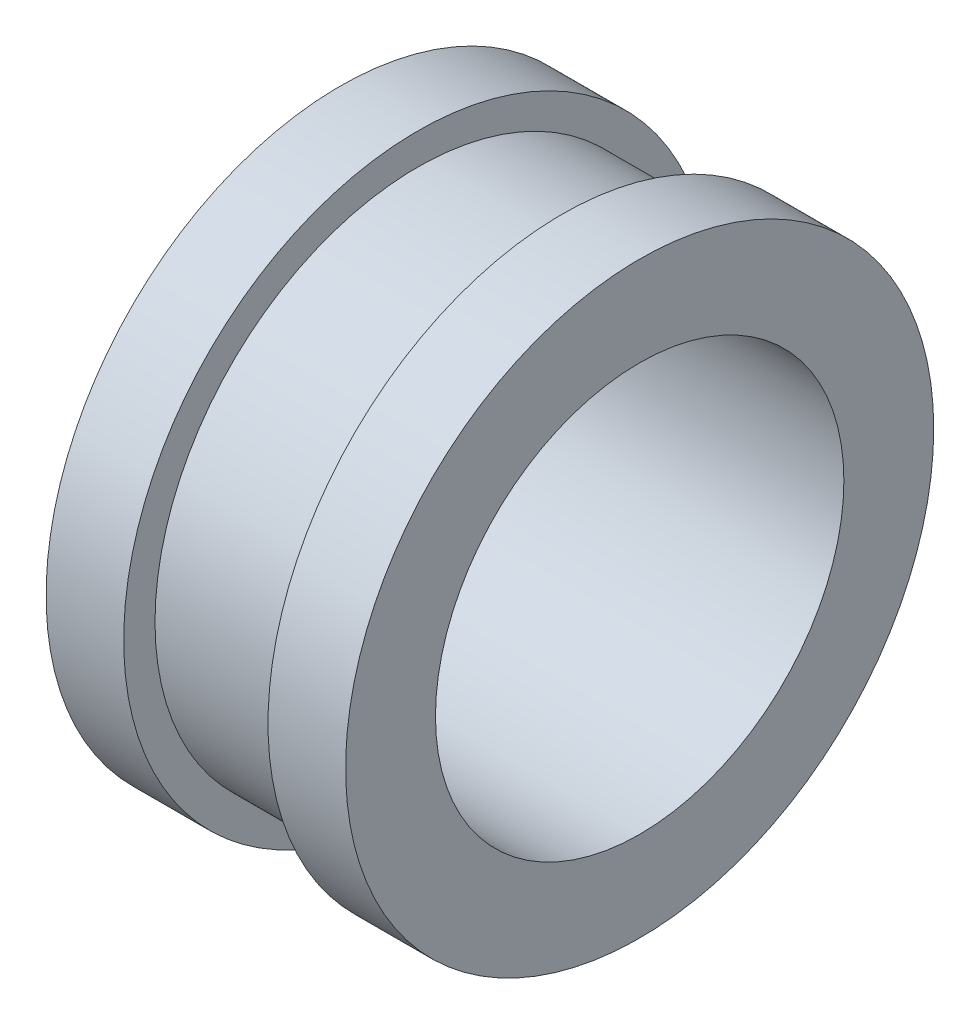
ISO-10303-21;
HEADER;
FILE_DESCRIPTION(('STEP AP214'),'2;1');
FILE_NAME('part.step','',(''),(''),'','','');
FILE_SCHEMA(('AUTOMOTIVE_DESIGN { 1 0 10303 214 1 1 1 1 }'));
ENDSEC;
DATA;
#1=APPLICATION_CONTEXT('core data for automotive mechanical design processes');
#2=APPLICATION_PROTOCOL_DEFINITION('international standard','automotive_design',2000,#1);
#3=PRODUCT_CONTEXT('',#1,'mechanical');
#4=PRODUCT('Part','Part','',(#3));
#5=PRODUCT_RELATED_PRODUCT_CATEGORY('part','',(#4));
#6=PRODUCT_DEFINITION_FORMATION('','',#4);
#7=PRODUCT_DEFINITION_CONTEXT('part definition',#1,'design');
#8=PRODUCT_DEFINITION('design','',#6,#7);
#9=PRODUCT_DEFINITION_SHAPE('','',#8);
#10=(LENGTH_UNIT() NAMED_UNIT(*) SI_UNIT(.MILLI.,.METRE.));
#11=(NAMED_UNIT(*) PLANE_ANGLE_UNIT() SI_UNIT($,.RADIAN.));
#12=(NAMED_UNIT(*) SI_UNIT($,.STERADIAN.) SOLID_ANGLE_UNIT());
#13=UNCERTAINTY_MEASURE_WITH_UNIT(LENGTH_MEASURE(1.E-05),#10,'distance_accuracy_value','');
#14=(GEOMETRIC_REPRESENTATION_CONTEXT(3) GLOBAL_UNCERTAINTY_ASSIGNED_CONTEXT((#13)) GLOBAL_UNIT_ASSIGNED_CONTEXT((#10,
#11,#12)) REPRESENTATION_CONTEXT('',''));
#15=CARTESIAN_POINT('',(0.,0.,0.));
#16=DIRECTION('',(0.,0.,1.));
#17=DIRECTION('',(1.,0.,0.));
#18=AXIS2_PLACEMENT_3D('',#15,#16,#17);
#19=CARTESIAN_POINT('',(5.5,0.,0.));
#20=DIRECTION('',(1.,0.,0.));
#21=DIRECTION('',(0.,0.,-1.));
#22=AXIS2_PLACEMENT_3D('',#19,#20,#21);
#23=CYLINDRICAL_SURFACE('',#22,9.65);
#24=CARTESIAN_POINT('',(8.15,0.,0.));
#25=DIRECTION('',(1.,0.,0.));
#26=DIRECTION('',(0.,0.,-1.));
#27=AXIS2_PLACEMENT_3D('',#24,#25,#26);
#28=CIRCLE('',#27,9.65);
#29=CARTESIAN_POINT('',(8.15,0.,-9.65));
#30=VERTEX_POINT('',#29);
#31=EDGE_CURVE('E39',#30,#30,#28,.T.);
#32=ORIENTED_EDGE('',*,*,#31,.F.);
#33=EDGE_LOOP('',(#32));
#34=FACE_BOUND('',#33,.T.);
#35=CARTESIAN_POINT('',(2.85,0.,0.));
#36=DIRECTION('',(1.,0.,0.));
#37=DIRECTION('',(0.,0.,-1.));
#38=AXIS2_PLACEMENT_3D('',#35,#36,#37);
#39=CIRCLE('',#38,9.65);
#40=CARTESIAN_POINT('',(2.85,0.,-9.65));
#41=VERTEX_POINT('',#40);
#42=EDGE_CURVE('E17',#41,#41,#39,.F.);
#43=ORIENTED_EDGE('',*,*,#42,.F.);
#44=EDGE_LOOP('',(#43));
#45=FACE_BOUND('',#44,.T.);
#46=ADVANCED_FACE('F14',(#34,#45),#23,.T.);
#47=CARTESIAN_POINT('',(2.85,0.,10.225));
#48=DIRECTION('',(1.,0.,0.));
#49=DIRECTION('',(0.,0.,-1.));
#50=AXIS2_PLACEMENT_3D('',#47,#48,#49);
#51=PLANE('',#50);
#52=CARTESIAN_POINT('',(2.85,0.,0.));
#53=DIRECTION('',(1.,0.,0.));
#54=DIRECTION('',(0.,0.,-1.));
#55=AXIS2_PLACEMENT_3D('',#52,#53,#54);
#56=CIRCLE('',#55,10.8);
#57=CARTESIAN_POINT('',(2.85,0.,-10.8));
#58=VERTEX_POINT('',#57);
#59=EDGE_CURVE('E37',#58,#58,#56,.F.);
#60=ORIENTED_EDGE('',*,*,#59,.F.);
#61=EDGE_LOOP('',(#60));
#62=FACE_BOUND('',#61,.T.);
#63=ORIENTED_EDGE('',*,*,#42,.T.);
#64=EDGE_LOOP('',(#63));
#65=FACE_BOUND('',#64,.T.);
#66=ADVANCED_FACE('F46',(#62,#65),#51,.T.);
#67=CARTESIAN_POINT('',(8.15,0.,10.225));
#68=DIRECTION('',(-1.,0.,0.));
#69=DIRECTION('',(0.,0.,1.));
#70=AXIS2_PLACEMENT_3D('',#67,#68,#69);
#71=PLANE('',#70);
#72=ORIENTED_EDGE('',*,*,#31,.T.);
#73=EDGE_LOOP('',(#72));
#74=FACE_BOUND('',#73,.T.);
#75=CARTESIAN_POINT('',(8.15,0.,0.));
#76=DIRECTION('',(1.,0.,0.));
#77=DIRECTION('',(0.,0.,-1.));
#78=AXIS2_PLACEMENT_3D('',#75,#76,#77);
#79=CIRCLE('',#78,10.8);
#80=CARTESIAN_POINT('',(8.15,0.,-10.8));
#81=VERTEX_POINT('',#80);
#82=EDGE_CURVE('E34',#81,#81,#79,.T.);
#83=ORIENTED_EDGE('',*,*,#82,.F.);
#84=EDGE_LOOP('',(#83));
#85=FACE_BOUND('',#84,.T.);
#86=ADVANCED_FACE('F54',(#74,#85),#71,.T.);
#87=CARTESIAN_POINT('',(1.425,0.,0.));
#88=DIRECTION('',(1.,0.,0.));
#89=DIRECTION('',(0.,0.,-1.));
#90=AXIS2_PLACEMENT_3D('',#87,#88,#89);
#91=CYLINDRICAL_SURFACE('',#90,10.8);
#92=ORIENTED_EDGE('',*,*,#59,.T.);
#93=EDGE_LOOP('',(#92));
#94=FACE_BOUND('',#93,.T.);
#95=CARTESIAN_POINT('',(0.,0.,0.));
#96=DIRECTION('',(1.,0.,0.));
#97=DIRECTION('',(0.,0.,-1.));
#98=AXIS2_PLACEMENT_3D('',#95,#96,#97);
#99=CIRCLE('',#98,10.8);
#100=CARTESIAN_POINT('',(0.,0.,-10.8));
#101=VERTEX_POINT('',#100);
#102=EDGE_CURVE('E31',#101,#101,#99,.F.);
#103=ORIENTED_EDGE('',*,*,#102,.F.);
#104=EDGE_LOOP('',(#103));
#105=FACE_BOUND('',#104,.T.);
#106=ADVANCED_FACE('F74',(#94,#105),#91,.T.);
#107=CARTESIAN_POINT('',(9.575,0.,0.));
#108=DIRECTION('',(1.,0.,0.));
#109=DIRECTION('',(0.,0.,-1.));
#110=AXIS2_PLACEMENT_3D('',#107,#108,#109);
#111=CYLINDRICAL_SURFACE('',#110,10.8);
#112=CARTESIAN_POINT('',(11.,0.,0.));
#113=DIRECTION('',(1.,0.,0.));
#114=DIRECTION('',(0.,0.,-1.));
#115=AXIS2_PLACEMENT_3D('',#112,#113,#114);
#116=CIRCLE('',#115,10.8);
#117=CARTESIAN_POINT('',(11.,0.,-10.8));
#118=VERTEX_POINT('',#117);
#119=EDGE_CURVE('E26',#118,#118,#116,.T.);
#120=ORIENTED_EDGE('',*,*,#119,.F.);
#121=EDGE_LOOP('',(#120));
#122=FACE_BOUND('',#121,.T.);
#123=ORIENTED_EDGE('',*,*,#82,.T.);
#124=EDGE_LOOP('',(#123));
#125=FACE_BOUND('',#124,.T.);
#126=ADVANCED_FACE('F70',(#122,#125),#111,.T.);
#127=CARTESIAN_POINT('',(0.,0.,9.15));
#128=DIRECTION('',(-1.,0.,0.));
#129=DIRECTION('',(0.,0.,1.));
#130=AXIS2_PLACEMENT_3D('',#127,#128,#129);
#131=PLANE('',#130);
#132=CARTESIAN_POINT('',(0.,0.,0.));
#133=DIRECTION('',(1.,0.,0.));
#134=DIRECTION('',(0.,0.,-1.));
#135=AXIS2_PLACEMENT_3D('',#132,#133,#134);
#136=CIRCLE('',#135,7.5);
#137=CARTESIAN_POINT('',(0.,0.,-7.5));
#138=VERTEX_POINT('',#137);
#139=EDGE_CURVE('E21',#138,#138,#136,.F.);
#140=ORIENTED_EDGE('',*,*,#139,.F.);
#141=EDGE_LOOP('',(#140));
#142=FACE_BOUND('',#141,.T.);
#143=ORIENTED_EDGE('',*,*,#102,.T.);
#144=EDGE_LOOP('',(#143));
#145=FACE_BOUND('',#144,.T.);
#146=ADVANCED_FACE('F64',(#142,#145),#131,.T.);
#147=CARTESIAN_POINT('',(11.,0.,9.15));
#148=DIRECTION('',(1.,0.,0.));
#149=DIRECTION('',(0.,0.,-1.));
#150=AXIS2_PLACEMENT_3D('',#147,#148,#149);
#151=PLANE('',#150);
#152=ORIENTED_EDGE('',*,*,#119,.T.);
#153=EDGE_LOOP('',(#152));
#154=FACE_BOUND('',#153,.T.);
#155=CARTESIAN_POINT('',(11.,0.,0.));
#156=DIRECTION('',(1.,0.,0.));
#157=DIRECTION('',(0.,0.,-1.));
#158=AXIS2_PLACEMENT_3D('',#155,#156,#157);
#159=CIRCLE('',#158,7.5);
#160=CARTESIAN_POINT('',(11.,0.,-7.5));
#161=VERTEX_POINT('',#160);
#162=EDGE_CURVE('E10',#161,#161,#159,.T.);
#163=ORIENTED_EDGE('',*,*,#162,.F.);
#164=EDGE_LOOP('',(#163));
#165=FACE_BOUND('',#164,.T.);
#166=ADVANCED_FACE('F58',(#154,#165),#151,.T.);
#167=CARTESIAN_POINT('',(0.,0.,0.));
#168=DIRECTION('',(1.,0.,0.));
#169=DIRECTION('',(0.,0.,-1.));
#170=AXIS2_PLACEMENT_3D('',#167,#168,#169);
#171=CYLINDRICAL_SURFACE('',#170,7.5);
#172=ORIENTED_EDGE('',*,*,#139,.T.);
#173=EDGE_LOOP('',(#172));
#174=FACE_BOUND('',#173,.T.);
#175=ORIENTED_EDGE('',*,*,#162,.T.);
#176=EDGE_LOOP('',(#175));
#177=FACE_BOUND('',#176,.T.);
#178=ADVANCED_FACE('F56',(#174,#177),#171,.F.);
#179=CLOSED_SHELL('',(#46,#66,#86,#106,#126,#146,#166,#178));
#180=MANIFOLD_SOLID_BREP('B1',#179);
#181=ADVANCED_BREP_SHAPE_REPRESENTATION('',(#18,#180),#14);
#182=SHAPE_DEFINITION_REPRESENTATION(#9,#181);
ENDSEC;
END-ISO-10303-21;
